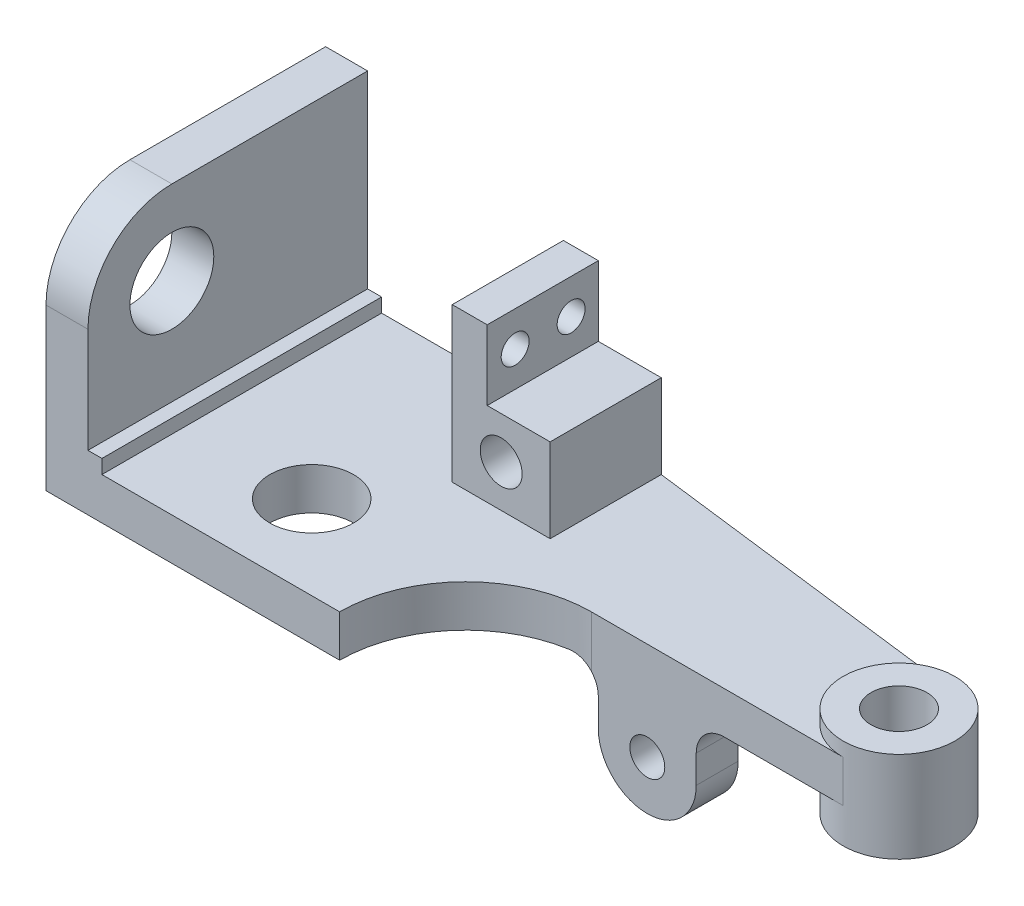
ISO-10303-21;
HEADER;
FILE_DESCRIPTION(('STEP AP214'),'2;1');
FILE_NAME('part.step','',(''),(''),'','','');
FILE_SCHEMA(('AUTOMOTIVE_DESIGN { 1 0 10303 214 1 1 1 1 }'));
ENDSEC;
DATA;
#1=APPLICATION_CONTEXT('core data for automotive mechanical design processes');
#2=APPLICATION_PROTOCOL_DEFINITION('international standard','automotive_design',2000,#1);
#3=PRODUCT_CONTEXT('',#1,'mechanical');
#4=PRODUCT('Part','Part','',(#3));
#5=PRODUCT_RELATED_PRODUCT_CATEGORY('part','',(#4));
#6=PRODUCT_DEFINITION_FORMATION('','',#4);
#7=PRODUCT_DEFINITION_CONTEXT('part definition',#1,'design');
#8=PRODUCT_DEFINITION('design','',#6,#7);
#9=PRODUCT_DEFINITION_SHAPE('','',#8);
#10=(LENGTH_UNIT() NAMED_UNIT(*) SI_UNIT(.MILLI.,.METRE.));
#11=(NAMED_UNIT(*) PLANE_ANGLE_UNIT() SI_UNIT($,.RADIAN.));
#12=(NAMED_UNIT(*) SI_UNIT($,.STERADIAN.) SOLID_ANGLE_UNIT());
#13=UNCERTAINTY_MEASURE_WITH_UNIT(LENGTH_MEASURE(1.E-05),#10,'distance_accuracy_value','');
#14=(GEOMETRIC_REPRESENTATION_CONTEXT(3) GLOBAL_UNCERTAINTY_ASSIGNED_CONTEXT((#13)) GLOBAL_UNIT_ASSIGNED_CONTEXT((#10,
#11,#12)) REPRESENTATION_CONTEXT('',''));
#15=CARTESIAN_POINT('',(0.,0.,0.));
#16=DIRECTION('',(0.,0.,1.));
#17=DIRECTION('',(1.,0.,0.));
#18=AXIS2_PLACEMENT_3D('',#15,#16,#17);
#19=CARTESIAN_POINT('',(95.25,9.525,-28.575));
#20=DIRECTION('',(0.,0.,-1.));
#21=DIRECTION('',(-1.,0.,0.));
#22=AXIS2_PLACEMENT_3D('',#19,#20,#21);
#23=PLANE('',#22);
#24=CARTESIAN_POINT('',(107.95,-12.7,-28.575));
#25=DIRECTION('',(0.,0.,1.));
#26=DIRECTION('',(1.,0.,0.));
#27=AXIS2_PLACEMENT_3D('',#24,#25,#26);
#28=CIRCLE('',#27,3.96874999999999);
#29=CARTESIAN_POINT('',(111.91875,-12.7,-28.575));
#30=VERTEX_POINT('',#29);
#31=EDGE_CURVE('E283',#30,#30,#28,.T.);
#32=ORIENTED_EDGE('',*,*,#31,.F.);
#33=EDGE_LOOP('',(#32));
#34=FACE_BOUND('',#33,.T.);
#35=DIRECTION('',(0.,1.,0.));
#36=VECTOR('',#35,1.);
#37=CARTESIAN_POINT('',(96.8375,-23.8125,-28.575));
#38=LINE('',#37,#36);
#39=CARTESIAN_POINT('',(96.8375,-12.7,-28.575));
#40=VERTEX_POINT('',#39);
#41=CARTESIAN_POINT('',(96.8375,-6.35,-28.575));
#42=VERTEX_POINT('',#41);
#43=EDGE_CURVE('E289',#40,#42,#38,.T.);
#44=ORIENTED_EDGE('',*,*,#43,.F.);
#45=CARTESIAN_POINT('',(107.95,-12.7,-28.575));
#46=DIRECTION('',(0.,0.,1.));
#47=DIRECTION('',(1.,0.,0.));
#48=AXIS2_PLACEMENT_3D('',#45,#46,#47);
#49=CIRCLE('',#48,11.1125);
#50=CARTESIAN_POINT('',(119.0625,-12.7,-28.575));
#51=VERTEX_POINT('',#50);
#52=EDGE_CURVE('E275',#40,#51,#49,.T.);
#53=ORIENTED_EDGE('',*,*,#52,.T.);
#54=DIRECTION('',(0.,1.,0.));
#55=VECTOR('',#54,1.);
#56=CARTESIAN_POINT('',(119.0625,-23.8125,-28.575));
#57=LINE('',#56,#55);
#58=CARTESIAN_POINT('',(119.0625,-6.35,-28.575));
#59=VERTEX_POINT('',#58);
#60=EDGE_CURVE('E292',#51,#59,#57,.T.);
#61=ORIENTED_EDGE('',*,*,#60,.T.);
#62=CARTESIAN_POINT('',(125.4125,-6.35,-28.575));
#63=DIRECTION('',(0.,0.,-1.));
#64=DIRECTION('',(-1.,0.,0.));
#65=AXIS2_PLACEMENT_3D('',#62,#63,#64);
#66=CIRCLE('',#65,6.35);
#67=CARTESIAN_POINT('',(125.4125,0.,-28.575));
#68=VERTEX_POINT('',#67);
#69=EDGE_CURVE('E458',#59,#68,#66,.T.);
#70=ORIENTED_EDGE('',*,*,#69,.T.);
#71=DIRECTION('',(1.,0.,0.));
#72=VECTOR('',#71,1.);
#73=CARTESIAN_POINT('',(95.25,0.,-28.575));
#74=LINE('',#73,#72);
#75=CARTESIAN_POINT('',(152.4,0.,-28.575));
#76=VERTEX_POINT('',#75);
#77=EDGE_CURVE('E444',#68,#76,#74,.T.);
#78=ORIENTED_EDGE('',*,*,#77,.T.);
#79=DIRECTION('',(0.,-1.,0.));
#80=VECTOR('',#79,1.);
#81=CARTESIAN_POINT('',(152.4,9.525,-28.575));
#82=LINE('',#81,#80);
#83=CARTESIAN_POINT('',(152.4,9.525,-28.575));
#84=VERTEX_POINT('',#83);
#85=EDGE_CURVE('E441',#84,#76,#82,.T.);
#86=ORIENTED_EDGE('',*,*,#85,.F.);
#87=DIRECTION('',(1.,0.,0.));
#88=VECTOR('',#87,1.);
#89=CARTESIAN_POINT('',(95.25,9.525,-28.575));
#90=LINE('',#89,#88);
#91=CARTESIAN_POINT('',(95.25,9.525,-28.575));
#92=VERTEX_POINT('',#91);
#93=EDGE_CURVE('E413',#92,#84,#90,.T.);
#94=ORIENTED_EDGE('',*,*,#93,.F.);
#95=DIRECTION('',(0.,-1.,0.));
#96=VECTOR('',#95,1.);
#97=CARTESIAN_POINT('',(95.25,9.525,-28.575));
#98=LINE('',#97,#96);
#99=CARTESIAN_POINT('',(95.25,-2.14986979368493,-28.575));
#100=VERTEX_POINT('',#99);
#101=EDGE_CURVE('E637',#92,#100,#98,.T.);
#102=ORIENTED_EDGE('',*,*,#101,.T.);
#103=CARTESIAN_POINT('',(90.4875,-6.35,-28.575));
#104=DIRECTION('',(0.,0.,-1.));
#105=DIRECTION('',(-1.,0.,0.));
#106=AXIS2_PLACEMENT_3D('',#103,#104,#105);
#107=CIRCLE('',#106,6.35);
#108=EDGE_CURVE('E12',#100,#42,#107,.T.);
#109=ORIENTED_EDGE('',*,*,#108,.T.);
#110=EDGE_LOOP('',(#44,#53,#61,#70,#78,#86,#94,#102,#109));
#111=FACE_BOUND('',#110,.T.);
#112=ADVANCED_FACE('F87',(#34,#111),#23,.F.);
#113=CARTESIAN_POINT('',(96.8375,-23.8125,-38.1));
#114=DIRECTION('',(0.,0.,1.));
#115=DIRECTION('',(1.,0.,0.));
#116=AXIS2_PLACEMENT_3D('',#113,#114,#115);
#117=PLANE('',#116);
#118=CARTESIAN_POINT('',(107.95,-12.7,-38.1));
#119=DIRECTION('',(0.,0.,1.));
#120=DIRECTION('',(1.,0.,0.));
#121=AXIS2_PLACEMENT_3D('',#118,#119,#120);
#122=CIRCLE('',#121,3.96874999999999);
#123=CARTESIAN_POINT('',(111.91875,-12.7,-38.1));
#124=VERTEX_POINT('',#123);
#125=EDGE_CURVE('E286',#124,#124,#122,.T.);
#126=ORIENTED_EDGE('',*,*,#125,.T.);
#127=EDGE_LOOP('',(#126));
#128=FACE_BOUND('',#127,.T.);
#129=CARTESIAN_POINT('',(107.95,-12.7,-38.1));
#130=DIRECTION('',(0.,0.,1.));
#131=DIRECTION('',(1.,0.,0.));
#132=AXIS2_PLACEMENT_3D('',#129,#130,#131);
#133=CIRCLE('',#132,11.1125);
#134=CARTESIAN_POINT('',(96.8375,-12.7,-38.1));
#135=VERTEX_POINT('',#134);
#136=CARTESIAN_POINT('',(119.0625,-12.7,-38.1));
#137=VERTEX_POINT('',#136);
#138=EDGE_CURVE('E281',#135,#137,#133,.T.);
#139=ORIENTED_EDGE('',*,*,#138,.F.);
#140=DIRECTION('',(0.,1.,0.));
#141=VECTOR('',#140,1.);
#142=CARTESIAN_POINT('',(96.8375,-23.8125,-38.1));
#143=LINE('',#142,#141);
#144=CARTESIAN_POINT('',(96.8375,-6.35,-38.1));
#145=VERTEX_POINT('',#144);
#146=EDGE_CURVE('E298',#135,#145,#143,.T.);
#147=ORIENTED_EDGE('',*,*,#146,.T.);
#148=CARTESIAN_POINT('',(90.4875,-6.35,-38.1));
#149=DIRECTION('',(0.,0.,1.));
#150=DIRECTION('',(1.,0.,0.));
#151=AXIS2_PLACEMENT_3D('',#148,#149,#150);
#152=CIRCLE('',#151,6.35);
#153=CARTESIAN_POINT('',(90.4875,0.,-38.1));
#154=VERTEX_POINT('',#153);
#155=EDGE_CURVE('E462',#145,#154,#152,.T.);
#156=ORIENTED_EDGE('',*,*,#155,.T.);
#157=DIRECTION('',(1.,0.,0.));
#158=VECTOR('',#157,1.);
#159=CARTESIAN_POINT('',(96.8375,0.,-38.1));
#160=LINE('',#159,#158);
#161=CARTESIAN_POINT('',(125.4125,0.,-38.1));
#162=VERTEX_POINT('',#161);
#163=EDGE_CURVE('E287',#154,#162,#160,.T.);
#164=ORIENTED_EDGE('',*,*,#163,.T.);
#165=CARTESIAN_POINT('',(125.4125,-6.35,-38.1));
#166=DIRECTION('',(0.,0.,1.));
#167=DIRECTION('',(1.,0.,0.));
#168=AXIS2_PLACEMENT_3D('',#165,#166,#167);
#169=CIRCLE('',#168,6.35);
#170=CARTESIAN_POINT('',(119.0625,-6.35,-38.1));
#171=VERTEX_POINT('',#170);
#172=EDGE_CURVE('E460',#162,#171,#169,.T.);
#173=ORIENTED_EDGE('',*,*,#172,.T.);
#174=DIRECTION('',(0.,1.,0.));
#175=VECTOR('',#174,1.);
#176=CARTESIAN_POINT('',(119.0625,-23.8125,-38.1));
#177=LINE('',#176,#175);
#178=EDGE_CURVE('E295',#137,#171,#177,.T.);
#179=ORIENTED_EDGE('',*,*,#178,.F.);
#180=EDGE_LOOP('',(#139,#147,#156,#164,#173,#179));
#181=FACE_BOUND('',#180,.T.);
#182=ADVANCED_FACE('F500',(#128,#181),#117,.F.);
#183=CARTESIAN_POINT('',(119.0625,-23.8125,-28.575));
#184=DIRECTION('',(-1.,0.,0.));
#185=DIRECTION('',(0.,0.,1.));
#186=AXIS2_PLACEMENT_3D('',#183,#184,#185);
#187=PLANE('',#186);
#188=ORIENTED_EDGE('',*,*,#178,.T.);
#189=DIRECTION('',(0.,0.,1.));
#190=VECTOR('',#189,1.);
#191=CARTESIAN_POINT('',(119.0625,-6.35,-28.575));
#192=LINE('',#191,#190);
#193=EDGE_CURVE('E448',#171,#59,#192,.T.);
#194=ORIENTED_EDGE('',*,*,#193,.T.);
#195=ORIENTED_EDGE('',*,*,#60,.F.);
#196=DIRECTION('',(0.,0.,1.));
#197=VECTOR('',#196,1.);
#198=CARTESIAN_POINT('',(119.0625,-12.7,-63.50005));
#199=LINE('',#198,#197);
#200=EDGE_CURVE('E279',#137,#51,#199,.T.);
#201=ORIENTED_EDGE('',*,*,#200,.F.);
#202=EDGE_LOOP('',(#188,#194,#195,#201));
#203=FACE_BOUND('',#202,.T.);
#204=ADVANCED_FACE('F505',(#203),#187,.F.);
#205=CARTESIAN_POINT('',(152.4,0.,-41.275));
#206=DIRECTION('',(0.,1.,0.));
#207=DIRECTION('',(0.,0.,1.));
#208=AXIS2_PLACEMENT_3D('',#205,#206,#207);
#209=PLANE('',#208);
#210=CARTESIAN_POINT('',(41.275,0.,-19.05));
#211=DIRECTION('',(0.,1.,0.));
#212=DIRECTION('',(0.,0.,1.));
#213=AXIS2_PLACEMENT_3D('',#210,#211,#212);
#214=CIRCLE('',#213,9.525);
#215=CARTESIAN_POINT('',(41.275,0.,-9.525));
#216=VERTEX_POINT('',#215);
#217=EDGE_CURVE('E406',#216,#216,#214,.T.);
#218=ORIENTED_EDGE('',*,*,#217,.T.);
#219=EDGE_LOOP('',(#218));
#220=FACE_BOUND('',#219,.T.);
#221=ORIENTED_EDGE('',*,*,#77,.F.);
#222=DIRECTION('',(0.,0.,1.));
#223=VECTOR('',#222,1.);
#224=CARTESIAN_POINT('',(125.4125,0.,-38.1));
#225=LINE('',#224,#223);
#226=EDGE_CURVE('E452',#68,#162,#225,.F.);
#227=ORIENTED_EDGE('',*,*,#226,.T.);
#228=ORIENTED_EDGE('',*,*,#163,.F.);
#229=DIRECTION('',(0.,0.,-1.));
#230=VECTOR('',#229,1.);
#231=CARTESIAN_POINT('',(90.4875,0.,-28.575));
#232=LINE('',#231,#230);
#233=CARTESIAN_POINT('',(90.4875,0.,-28.1753299670119));
#234=VERTEX_POINT('',#233);
#235=EDGE_CURVE('E450',#154,#234,#232,.F.);
#236=ORIENTED_EDGE('',*,*,#235,.T.);
#237=CARTESIAN_POINT('',(95.25,0.,0.));
#238=DIRECTION('',(0.,-1.,0.));
#239=DIRECTION('',(0.,0.,-1.));
#240=AXIS2_PLACEMENT_3D('',#237,#238,#239);
#241=CIRCLE('',#240,28.575);
#242=CARTESIAN_POINT('',(66.675,0.,0.));
#243=VERTEX_POINT('',#242);
#244=EDGE_CURVE('E447',#243,#234,#241,.T.);
#245=ORIENTED_EDGE('',*,*,#244,.F.);
#246=DIRECTION('',(1.,0.,0.));
#247=VECTOR('',#246,1.);
#248=CARTESIAN_POINT('',(0.,0.,0.));
#249=LINE('',#248,#247);
#250=CARTESIAN_POINT('',(0.,0.,0.));
#251=VERTEX_POINT('',#250);
#252=EDGE_CURVE('E673',#251,#243,#249,.T.);
#253=ORIENTED_EDGE('',*,*,#252,.F.);
#254=DIRECTION('',(0.,0.,1.));
#255=VECTOR('',#254,1.);
#256=CARTESIAN_POINT('',(0.,0.,0.));
#257=LINE('',#256,#255);
#258=CARTESIAN_POINT('',(0.,0.,-63.5));
#259=VERTEX_POINT('',#258);
#260=EDGE_CURVE('E405',#259,#251,#257,.T.);
#261=ORIENTED_EDGE('',*,*,#260,.F.);
#262=DIRECTION('',(-1.,0.,0.));
#263=VECTOR('',#262,1.);
#264=CARTESIAN_POINT('',(0.,0.,-63.5));
#265=LINE('',#264,#263);
#266=CARTESIAN_POINT('',(76.2,0.,-63.5));
#267=VERTEX_POINT('',#266);
#268=EDGE_CURVE('E667',#267,#259,#265,.T.);
#269=ORIENTED_EDGE('',*,*,#268,.F.);
#270=DIRECTION('',(-0.992277876713668,0.,-0.124034734589209));
#271=VECTOR('',#270,1.);
#272=CARTESIAN_POINT('',(152.4,0.,-53.975));
#273=LINE('',#272,#271);
#274=CARTESIAN_POINT('',(152.4,0.,-53.975));
#275=VERTEX_POINT('',#274);
#276=EDGE_CURVE('E428',#275,#267,#273,.T.);
#277=ORIENTED_EDGE('',*,*,#276,.F.);
#278=CARTESIAN_POINT('',(152.4,0.,-41.275));
#279=DIRECTION('',(0.,-1.,0.));
#280=DIRECTION('',(0.,0.,-1.));
#281=AXIS2_PLACEMENT_3D('',#278,#279,#280);
#282=CIRCLE('',#281,12.7);
#283=EDGE_CURVE('E431',#76,#275,#282,.T.);
#284=ORIENTED_EDGE('',*,*,#283,.F.);
#285=EDGE_LOOP('',(#221,#227,#228,#236,#245,#253,#261,#269,#277,#284));
#286=FACE_BOUND('',#285,.T.);
#287=ADVANCED_FACE('F541',(#220,#286),#209,.F.);
#288=CARTESIAN_POINT('',(0.,28.575,0.));
#289=DIRECTION('',(0.,-1.,0.));
#290=DIRECTION('',(0.,0.,-1.));
#291=AXIS2_PLACEMENT_3D('',#288,#289,#290);
#292=PLANE('',#291);
#293=DIRECTION('',(0.,0.,-1.));
#294=VECTOR('',#293,1.);
#295=CARTESIAN_POINT('',(61.9125,28.575,-63.5));
#296=LINE('',#295,#294);
#297=CARTESIAN_POINT('',(61.9125,28.575,-38.2663264185679));
#298=VERTEX_POINT('',#297);
#299=CARTESIAN_POINT('',(61.9125,28.575,-63.5));
#300=VERTEX_POINT('',#299);
#301=EDGE_CURVE('E328',#298,#300,#296,.T.);
#302=ORIENTED_EDGE('',*,*,#301,.F.);
#303=DIRECTION('',(1.,0.,0.));
#304=VECTOR('',#303,1.);
#305=CARTESIAN_POINT('',(76.2,28.575,-38.2663264185679));
#306=LINE('',#305,#304);
#307=CARTESIAN_POINT('',(76.2,28.575,-38.2663264185679));
#308=VERTEX_POINT('',#307);
#309=EDGE_CURVE('E354',#298,#308,#306,.T.);
#310=ORIENTED_EDGE('',*,*,#309,.T.);
#311=DIRECTION('',(0.,0.,-1.));
#312=VECTOR('',#311,1.);
#313=CARTESIAN_POINT('',(76.2,28.575,-63.5));
#314=LINE('',#313,#312);
#315=CARTESIAN_POINT('',(76.2,28.575,-63.5));
#316=VERTEX_POINT('',#315);
#317=EDGE_CURVE('E348',#308,#316,#314,.T.);
#318=ORIENTED_EDGE('',*,*,#317,.T.);
#319=DIRECTION('',(-1.,0.,0.));
#320=VECTOR('',#319,1.);
#321=CARTESIAN_POINT('',(76.2,28.575,-63.5));
#322=LINE('',#321,#320);
#323=EDGE_CURVE('E351',#316,#300,#322,.T.);
#324=ORIENTED_EDGE('',*,*,#323,.T.);
#325=EDGE_LOOP('',(#302,#310,#318,#324));
#326=FACE_BOUND('',#325,.T.);
#327=ADVANCED_FACE('F572',(#326),#292,.F.);
#328=CARTESIAN_POINT('',(152.4,9.525,-41.275));
#329=DIRECTION('',(0.,1.,0.));
#330=DIRECTION('',(0.,0.,1.));
#331=AXIS2_PLACEMENT_3D('',#328,#329,#330);
#332=PLANE('',#331);
#333=DIRECTION('',(0.,0.,1.));
#334=VECTOR('',#333,1.);
#335=CARTESIAN_POINT('',(12.7,9.525,-63.5));
#336=LINE('',#335,#334);
#337=CARTESIAN_POINT('',(12.7,9.525,-63.5));
#338=VERTEX_POINT('',#337);
#339=CARTESIAN_POINT('',(12.7,9.525,0.));
#340=VERTEX_POINT('',#339);
#341=EDGE_CURVE('E105',#338,#340,#336,.T.);
#342=ORIENTED_EDGE('',*,*,#341,.T.);
#343=DIRECTION('',(1.,0.,0.));
#344=VECTOR('',#343,1.);
#345=CARTESIAN_POINT('',(0.,9.525,0.));
#346=LINE('',#345,#344);
#347=CARTESIAN_POINT('',(66.675,9.525,0.));
#348=VERTEX_POINT('',#347);
#349=EDGE_CURVE('E92',#340,#348,#346,.T.);
#350=ORIENTED_EDGE('',*,*,#349,.T.);
#351=CARTESIAN_POINT('',(95.25,9.525,0.));
#352=DIRECTION('',(0.,-1.,0.));
#353=DIRECTION('',(0.,0.,-1.));
#354=AXIS2_PLACEMENT_3D('',#351,#352,#353);
#355=CIRCLE('',#354,28.575);
#356=EDGE_CURVE('E411',#348,#92,#355,.T.);
#357=ORIENTED_EDGE('',*,*,#356,.T.);
#358=ORIENTED_EDGE('',*,*,#93,.T.);
#359=CARTESIAN_POINT('',(152.4,9.525,-41.275));
#360=DIRECTION('',(0.,1.,0.));
#361=DIRECTION('',(0.,0.,1.));
#362=AXIS2_PLACEMENT_3D('',#359,#360,#361);
#363=CIRCLE('',#362,12.7);
#364=CARTESIAN_POINT('',(152.4,9.525,-53.975));
#365=VERTEX_POINT('',#364);
#366=EDGE_CURVE('E375',#365,#84,#363,.T.);
#367=ORIENTED_EDGE('',*,*,#366,.F.);
#368=DIRECTION('',(-0.992277876713668,0.,-0.124034734589209));
#369=VECTOR('',#368,1.);
#370=CARTESIAN_POINT('',(152.4,9.525,-53.975));
#371=LINE('',#370,#369);
#372=CARTESIAN_POINT('',(76.2,9.525,-63.5));
#373=VERTEX_POINT('',#372);
#374=EDGE_CURVE('E415',#365,#373,#371,.T.);
#375=ORIENTED_EDGE('',*,*,#374,.T.);
#376=DIRECTION('',(0.,0.,-1.));
#377=VECTOR('',#376,1.);
#378=CARTESIAN_POINT('',(76.2,9.525,-63.5));
#379=LINE('',#378,#377);
#380=CARTESIAN_POINT('',(76.2,9.525,-38.2663264185679));
#381=VERTEX_POINT('',#380);
#382=EDGE_CURVE('E347',#381,#373,#379,.T.);
#383=ORIENTED_EDGE('',*,*,#382,.F.);
#384=DIRECTION('',(1.,0.,0.));
#385=VECTOR('',#384,1.);
#386=CARTESIAN_POINT('',(76.2,9.525,-38.2663264185679));
#387=LINE('',#386,#385);
#388=CARTESIAN_POINT('',(53.975,9.525,-38.2663264185679));
#389=VERTEX_POINT('',#388);
#390=EDGE_CURVE('E352',#389,#381,#387,.T.);
#391=ORIENTED_EDGE('',*,*,#390,.F.);
#392=DIRECTION('',(0.,0.,1.));
#393=VECTOR('',#392,1.);
#394=CARTESIAN_POINT('',(53.975,9.525,-63.5));
#395=LINE('',#394,#393);
#396=CARTESIAN_POINT('',(53.975,9.525,-63.5));
#397=VERTEX_POINT('',#396);
#398=EDGE_CURVE('E359',#397,#389,#395,.T.);
#399=ORIENTED_EDGE('',*,*,#398,.F.);
#400=DIRECTION('',(-1.,0.,0.));
#401=VECTOR('',#400,1.);
#402=CARTESIAN_POINT('',(61.9125,9.525,-63.5));
#403=LINE('',#402,#401);
#404=EDGE_CURVE('E110',#397,#338,#403,.T.);
#405=ORIENTED_EDGE('',*,*,#404,.T.);
#406=EDGE_LOOP('',(#342,#350,#357,#358,#367,#375,#383,#391,#399,#405));
#407=FACE_BOUND('',#406,.T.);
#408=CARTESIAN_POINT('',(41.275,9.525,-19.05));
#409=DIRECTION('',(0.,1.,0.));
#410=DIRECTION('',(0.,0.,1.));
#411=AXIS2_PLACEMENT_3D('',#408,#409,#410);
#412=CIRCLE('',#411,9.525);
#413=CARTESIAN_POINT('',(41.275,9.525,-9.525));
#414=VERTEX_POINT('',#413);
#415=EDGE_CURVE('E402',#414,#414,#412,.T.);
#416=ORIENTED_EDGE('',*,*,#415,.F.);
#417=EDGE_LOOP('',(#416));
#418=FACE_BOUND('',#417,.T.);
#419=ADVANCED_FACE('F575',(#407,#418),#332,.T.);
#420=CARTESIAN_POINT('',(0.,55.5625,0.));
#421=DIRECTION('',(0.,-1.,0.));
#422=DIRECTION('',(0.,0.,-1.));
#423=AXIS2_PLACEMENT_3D('',#420,#421,#422);
#424=PLANE('',#423);
#425=DIRECTION('',(1.,0.,0.));
#426=VECTOR('',#425,1.);
#427=CARTESIAN_POINT('',(-36.5125,55.5625,-19.05));
#428=LINE('',#427,#426);
#429=CARTESIAN_POINT('',(9.525,55.5625,-19.05));
#430=VERTEX_POINT('',#429);
#431=CARTESIAN_POINT('',(0.,55.5625,-19.05));
#432=VERTEX_POINT('',#431);
#433=EDGE_CURVE('E436',#430,#432,#428,.F.);
#434=ORIENTED_EDGE('',*,*,#433,.F.);
#435=DIRECTION('',(0.,0.,-1.));
#436=VECTOR('',#435,1.);
#437=CARTESIAN_POINT('',(9.525,55.5625,0.));
#438=LINE('',#437,#436);
#439=CARTESIAN_POINT('',(9.525,55.5625,-63.5));
#440=VERTEX_POINT('',#439);
#441=EDGE_CURVE('E397',#430,#440,#438,.T.);
#442=ORIENTED_EDGE('',*,*,#441,.T.);
#443=DIRECTION('',(-1.,0.,0.));
#444=VECTOR('',#443,1.);
#445=CARTESIAN_POINT('',(0.,55.5625,-63.5));
#446=LINE('',#445,#444);
#447=CARTESIAN_POINT('',(0.,55.5625,-63.5));
#448=VERTEX_POINT('',#447);
#449=EDGE_CURVE('E399',#440,#448,#446,.T.);
#450=ORIENTED_EDGE('',*,*,#449,.T.);
#451=DIRECTION('',(0.,0.,1.));
#452=VECTOR('',#451,1.);
#453=CARTESIAN_POINT('',(0.,55.5625,0.));
#454=LINE('',#453,#452);
#455=EDGE_CURVE('E394',#448,#432,#454,.T.);
#456=ORIENTED_EDGE('',*,*,#455,.T.);
#457=EDGE_LOOP('',(#434,#442,#450,#456));
#458=FACE_BOUND('',#457,.T.);
#459=ADVANCED_FACE('F484',(#458),#424,.F.);
#460=CARTESIAN_POINT('',(0.,9.525,0.));
#461=DIRECTION('',(1.,0.,0.));
#462=DIRECTION('',(0.,0.,-1.));
#463=AXIS2_PLACEMENT_3D('',#460,#461,#462);
#464=PLANE('',#463);
#465=CARTESIAN_POINT('',(0.,36.5125,-19.05));
#466=DIRECTION('',(1.,0.,0.));
#467=DIRECTION('',(0.,0.,-1.));
#468=AXIS2_PLACEMENT_3D('',#465,#466,#467);
#469=CIRCLE('',#468,9.525);
#470=CARTESIAN_POINT('',(0.,36.5125,-28.575));
#471=VERTEX_POINT('',#470);
#472=EDGE_CURVE('E391',#471,#471,#469,.T.);
#473=ORIENTED_EDGE('',*,*,#472,.T.);
#474=EDGE_LOOP('',(#473));
#475=FACE_BOUND('',#474,.T.);
#476=DIRECTION('',(0.,-1.,0.));
#477=VECTOR('',#476,1.);
#478=CARTESIAN_POINT('',(0.,9.525,0.));
#479=LINE('',#478,#477);
#480=CARTESIAN_POINT('',(0.,36.5125,0.));
#481=VERTEX_POINT('',#480);
#482=EDGE_CURVE('E654',#481,#251,#479,.T.);
#483=ORIENTED_EDGE('',*,*,#482,.F.);
#484=CARTESIAN_POINT('',(0.,36.5125,-19.05));
#485=DIRECTION('',(1.,0.,0.));
#486=DIRECTION('',(0.,0.,-1.));
#487=AXIS2_PLACEMENT_3D('',#484,#485,#486);
#488=CIRCLE('',#487,19.05);
#489=EDGE_CURVE('E385',#481,#432,#488,.F.);
#490=ORIENTED_EDGE('',*,*,#489,.T.);
#491=ORIENTED_EDGE('',*,*,#455,.F.);
#492=DIRECTION('',(0.,-1.,0.));
#493=VECTOR('',#492,1.);
#494=CARTESIAN_POINT('',(0.,9.525,-63.5));
#495=LINE('',#494,#493);
#496=EDGE_CURVE('E423',#448,#259,#495,.T.);
#497=ORIENTED_EDGE('',*,*,#496,.T.);
#498=ORIENTED_EDGE('',*,*,#260,.T.);
#499=EDGE_LOOP('',(#483,#490,#491,#497,#498));
#500=FACE_BOUND('',#499,.T.);
#501=ADVANCED_FACE('F481',(#475,#500),#464,.F.);
#502=CARTESIAN_POINT('',(0.,9.525,0.));
#503=DIRECTION('',(0.,0.,-1.));
#504=DIRECTION('',(-1.,0.,0.));
#505=AXIS2_PLACEMENT_3D('',#502,#503,#504);
#506=PLANE('',#505);
#507=ORIENTED_EDGE('',*,*,#349,.F.);
#508=DIRECTION('',(0.,1.,0.));
#509=VECTOR('',#508,1.);
#510=CARTESIAN_POINT('',(12.7,9.525,0.));
#511=LINE('',#510,#509);
#512=CARTESIAN_POINT('',(12.7,12.7,0.));
#513=VERTEX_POINT('',#512);
#514=EDGE_CURVE('E272',#340,#513,#511,.T.);
#515=ORIENTED_EDGE('',*,*,#514,.T.);
#516=DIRECTION('',(-1.,0.,0.));
#517=VECTOR('',#516,1.);
#518=CARTESIAN_POINT('',(9.525,12.7,0.));
#519=LINE('',#518,#517);
#520=CARTESIAN_POINT('',(9.525,12.7,0.));
#521=VERTEX_POINT('',#520);
#522=EDGE_CURVE('E252',#513,#521,#519,.T.);
#523=ORIENTED_EDGE('',*,*,#522,.T.);
#524=DIRECTION('',(0.,-1.,0.));
#525=VECTOR('',#524,1.);
#526=CARTESIAN_POINT('',(9.525,55.5625,0.));
#527=LINE('',#526,#525);
#528=CARTESIAN_POINT('',(9.525,36.5125,0.));
#529=VERTEX_POINT('',#528);
#530=EDGE_CURVE('E408',#529,#521,#527,.T.);
#531=ORIENTED_EDGE('',*,*,#530,.F.);
#532=DIRECTION('',(1.,0.,0.));
#533=VECTOR('',#532,1.);
#534=CARTESIAN_POINT('',(-36.5125,36.5125,0.));
#535=LINE('',#534,#533);
#536=EDGE_CURVE('E383',#481,#529,#535,.T.);
#537=ORIENTED_EDGE('',*,*,#536,.F.);
#538=ORIENTED_EDGE('',*,*,#482,.T.);
#539=ORIENTED_EDGE('',*,*,#252,.T.);
#540=DIRECTION('',(0.,-1.,0.));
#541=VECTOR('',#540,1.);
#542=CARTESIAN_POINT('',(66.675,9.525,0.));
#543=LINE('',#542,#541);
#544=EDGE_CURVE('E639',#348,#243,#543,.T.);
#545=ORIENTED_EDGE('',*,*,#544,.F.);
#546=EDGE_LOOP('',(#507,#515,#523,#531,#537,#538,#539,#545));
#547=FACE_BOUND('',#546,.T.);
#548=ADVANCED_FACE('F476',(#547),#506,.F.);
#549=CARTESIAN_POINT('',(95.25,9.525,0.));
#550=DIRECTION('',(0.,-1.,0.));
#551=DIRECTION('',(0.,0.,-1.));
#552=AXIS2_PLACEMENT_3D('',#549,#550,#551);
#553=CYLINDRICAL_SURFACE('',#552,28.575);
#554=ORIENTED_EDGE('',*,*,#244,.T.);
#555=CARTESIAN_POINT('',(90.4875,0.,-28.1753299670119));
#556=CARTESIAN_POINT('',(90.6613034391203,2.07788100532369E-05,-28.2047241582629));
#557=CARTESIAN_POINT('',(90.8353906081418,-0.00713504540515849,-28.2324805663496));
#558=CARTESIAN_POINT('',(91.1828977785426,-0.0357898843089191,-28.2846236418446));
#559=CARTESIAN_POINT('',(91.3563177386743,-0.0572897718756807,-28.3090101040729));
#560=CARTESIAN_POINT('',(91.701158762223,-0.114610148149816,-28.3543055764779));
#561=CARTESIAN_POINT('',(91.8725806690322,-0.150424351419796,-28.3752161072426));
#562=CARTESIAN_POINT('',(92.2122286779602,-0.236205442733259,-28.4135840992128));
#563=CARTESIAN_POINT('',(92.3804549933941,-0.286171382539645,-28.4310417916425));
#564=CARTESIAN_POINT('',(92.7126728082575,-0.400043890921936,-28.4626154390882));
#565=CARTESIAN_POINT('',(92.8766589706755,-0.4639671549902,-28.4767273494078));
#566=CARTESIAN_POINT('',(93.1989602267913,-0.605311293771183,-28.5017541547165));
#567=CARTESIAN_POINT('',(93.3572753004575,-0.682732216155057,-28.5126690384138));
#568=CARTESIAN_POINT('',(93.6668985936843,-0.850464515407376,-28.5315342858627));
#569=CARTESIAN_POINT('',(93.8182137821993,-0.940762689477037,-28.5394876562029));
#570=CARTESIAN_POINT('',(94.1128473217269,-1.13364490750614,-28.5527452038371));
#571=CARTESIAN_POINT('',(94.2561681698495,-1.23622508320303,-28.5580502125354));
#572=CARTESIAN_POINT('',(94.5495792130265,-1.46528567158354,-28.5668327404553));
#573=CARTESIAN_POINT('',(94.6985940875537,-1.59315723327733,-28.5700348115458));
#574=CARTESIAN_POINT('',(94.9840147228799,-1.86197670015115,-28.5741194955508));
#575=CARTESIAN_POINT('',(95.1204355411883,-2.00290857535153,-28.5750049138422));
#576=CARTESIAN_POINT('',(95.25,-2.14986979368493,-28.575));
#577=B_SPLINE_CURVE_WITH_KNOTS('',3,(#555,#556,#557,#558,#559,#560,#561,#562,#563,#564,#565,
#566,#567,#568,#569,#570,#571,#572,#573,#574,#575,#576),.UNSPECIFIED.,.F.,.F.,(4,2,2,2,2,2,2,2,
2,2,4),(0.,0.528671504172429,1.05737518248702,1.58584696083068,2.11428333729705,
2.64335531670023,3.17242916472259,3.70096441220385,4.22933363125771,4.81761830651145,
5.40519026133262),.UNSPECIFIED.);
#578=EDGE_CURVE('E98',#234,#100,#577,.T.);
#579=ORIENTED_EDGE('',*,*,#578,.T.);
#580=ORIENTED_EDGE('',*,*,#101,.F.);
#581=ORIENTED_EDGE('',*,*,#356,.F.);
#582=ORIENTED_EDGE('',*,*,#544,.T.);
#583=EDGE_LOOP('',(#554,#579,#580,#581,#582));
#584=FACE_BOUND('',#583,.T.);
#585=ADVANCED_FACE('F470',(#584),#553,.F.);
#586=CARTESIAN_POINT('',(152.4,9.525,-41.275));
#587=DIRECTION('',(0.,-1.,0.));
#588=DIRECTION('',(0.,0.,-1.));
#589=AXIS2_PLACEMENT_3D('',#586,#587,#588);
#590=CYLINDRICAL_SURFACE('',#589,12.7);
#591=ORIENTED_EDGE('',*,*,#85,.T.);
#592=ORIENTED_EDGE('',*,*,#283,.T.);
#593=DIRECTION('',(0.,-1.,0.));
#594=VECTOR('',#593,1.);
#595=CARTESIAN_POINT('',(152.4,9.525,-53.975));
#596=LINE('',#595,#594);
#597=EDGE_CURVE('E638',#365,#275,#596,.T.);
#598=ORIENTED_EDGE('',*,*,#597,.F.);
#599=ORIENTED_EDGE('',*,*,#366,.T.);
#600=EDGE_LOOP('',(#591,#592,#598,#599));
#601=FACE_BOUND('',#600,.T.);
#602=CARTESIAN_POINT('',(152.4,12.7,-41.275));
#603=DIRECTION('',(0.,1.,0.));
#604=DIRECTION('',(0.,0.,1.));
#605=AXIS2_PLACEMENT_3D('',#602,#603,#604);
#606=CIRCLE('',#605,12.7);
#607=CARTESIAN_POINT('',(152.4,12.7,-28.575));
#608=VERTEX_POINT('',#607);
#609=EDGE_CURVE('E376',#608,#608,#606,.T.);
#610=ORIENTED_EDGE('',*,*,#609,.F.);
#611=EDGE_LOOP('',(#610));
#612=FACE_BOUND('',#611,.T.);
#613=CARTESIAN_POINT('',(152.4,-7.9375,-41.275));
#614=DIRECTION('',(0.,-1.,0.));
#615=DIRECTION('',(0.,0.,-1.));
#616=AXIS2_PLACEMENT_3D('',#613,#614,#615);
#617=CIRCLE('',#616,12.7);
#618=CARTESIAN_POINT('',(152.4,-7.9375,-53.975));
#619=VERTEX_POINT('',#618);
#620=EDGE_CURVE('E305',#619,#619,#617,.T.);
#621=ORIENTED_EDGE('',*,*,#620,.F.);
#622=EDGE_LOOP('',(#621));
#623=FACE_BOUND('',#622,.T.);
#624=ADVANCED_FACE('F475',(#601,#612,#623),#590,.T.);
#625=CARTESIAN_POINT('',(152.4,9.525,-53.975));
#626=DIRECTION('',(-0.124034734589208,0.,0.992277876713668));
#627=DIRECTION('',(0.992277876713668,0.,0.124034734589209));
#628=AXIS2_PLACEMENT_3D('',#625,#626,#627);
#629=PLANE('',#628);
#630=ORIENTED_EDGE('',*,*,#276,.T.);
#631=DIRECTION('',(0.,-1.,0.));
#632=VECTOR('',#631,1.);
#633=CARTESIAN_POINT('',(76.2,9.525,-63.5));
#634=LINE('',#633,#632);
#635=EDGE_CURVE('E642',#373,#267,#634,.T.);
#636=ORIENTED_EDGE('',*,*,#635,.F.);
#637=ORIENTED_EDGE('',*,*,#374,.F.);
#638=ORIENTED_EDGE('',*,*,#597,.T.);
#639=EDGE_LOOP('',(#630,#636,#637,#638));
#640=FACE_BOUND('',#639,.T.);
#641=ADVANCED_FACE('F618',(#640),#629,.F.);
#642=CARTESIAN_POINT('',(0.,9.525,-63.5));
#643=DIRECTION('',(0.,0.,1.));
#644=DIRECTION('',(1.,0.,0.));
#645=AXIS2_PLACEMENT_3D('',#642,#643,#644);
#646=PLANE('',#645);
#647=DIRECTION('',(0.,1.,0.));
#648=VECTOR('',#647,1.);
#649=CARTESIAN_POINT('',(12.7,9.525,-63.5));
#650=LINE('',#649,#648);
#651=CARTESIAN_POINT('',(12.7,12.7,-63.5));
#652=VERTEX_POINT('',#651);
#653=EDGE_CURVE('E259',#338,#652,#650,.T.);
#654=ORIENTED_EDGE('',*,*,#653,.F.);
#655=ORIENTED_EDGE('',*,*,#404,.F.);
#656=DIRECTION('',(0.,-1.,0.));
#657=VECTOR('',#656,1.);
#658=CARTESIAN_POINT('',(53.975,28.575,-63.5));
#659=LINE('',#658,#657);
#660=CARTESIAN_POINT('',(53.975,44.45,-63.5));
#661=VERTEX_POINT('',#660);
#662=EDGE_CURVE('E369',#661,#397,#659,.T.);
#663=ORIENTED_EDGE('',*,*,#662,.F.);
#664=DIRECTION('',(-1.,0.,0.));
#665=VECTOR('',#664,1.);
#666=CARTESIAN_POINT('',(53.975,44.45,-63.5));
#667=LINE('',#666,#665);
#668=CARTESIAN_POINT('',(61.9125,44.45,-63.5));
#669=VERTEX_POINT('',#668);
#670=EDGE_CURVE('E336',#669,#661,#667,.T.);
#671=ORIENTED_EDGE('',*,*,#670,.F.);
#672=DIRECTION('',(0.,-1.,0.));
#673=VECTOR('',#672,1.);
#674=CARTESIAN_POINT('',(61.9125,44.45,-63.5));
#675=LINE('',#674,#673);
#676=EDGE_CURVE('E339',#669,#300,#675,.T.);
#677=ORIENTED_EDGE('',*,*,#676,.T.);
#678=ORIENTED_EDGE('',*,*,#323,.F.);
#679=DIRECTION('',(0.,-1.,0.));
#680=VECTOR('',#679,1.);
#681=CARTESIAN_POINT('',(76.2,28.575,-63.5));
#682=LINE('',#681,#680);
#683=EDGE_CURVE('E372',#316,#373,#682,.T.);
#684=ORIENTED_EDGE('',*,*,#683,.T.);
#685=ORIENTED_EDGE('',*,*,#635,.T.);
#686=ORIENTED_EDGE('',*,*,#268,.T.);
#687=ORIENTED_EDGE('',*,*,#496,.F.);
#688=ORIENTED_EDGE('',*,*,#449,.F.);
#689=DIRECTION('',(0.,-1.,0.));
#690=VECTOR('',#689,1.);
#691=CARTESIAN_POINT('',(9.525,55.5625,-63.5));
#692=LINE('',#691,#690);
#693=CARTESIAN_POINT('',(9.525,12.7,-63.5));
#694=VERTEX_POINT('',#693);
#695=EDGE_CURVE('E268',#440,#694,#692,.T.);
#696=ORIENTED_EDGE('',*,*,#695,.T.);
#697=DIRECTION('',(-1.,0.,0.));
#698=VECTOR('',#697,1.);
#699=CARTESIAN_POINT('',(9.525,12.7,-63.5));
#700=LINE('',#699,#698);
#701=EDGE_CURVE('E250',#652,#694,#700,.T.);
#702=ORIENTED_EDGE('',*,*,#701,.F.);
#703=EDGE_LOOP('',(#654,#655,#663,#671,#677,#678,#684,#685,#686,#687,#688,#696,#702));
#704=FACE_BOUND('',#703,.T.);
#705=CARTESIAN_POINT('',(65.0875,19.05,-63.5));
#706=DIRECTION('',(0.,0.,1.));
#707=DIRECTION('',(1.,0.,0.));
#708=AXIS2_PLACEMENT_3D('',#705,#706,#707);
#709=CIRCLE('',#708,4.7625);
#710=CARTESIAN_POINT('',(69.85,19.05,-63.5));
#711=VERTEX_POINT('',#710);
#712=EDGE_CURVE('E313',#711,#711,#709,.T.);
#713=ORIENTED_EDGE('',*,*,#712,.T.);
#714=EDGE_LOOP('',(#713));
#715=FACE_BOUND('',#714,.T.);
#716=ADVANCED_FACE('F264',(#704,#715),#646,.F.);
#717=CARTESIAN_POINT('',(41.275,9.525,-19.05));
#718=DIRECTION('',(0.,-1.,0.));
#719=DIRECTION('',(0.,0.,-1.));
#720=AXIS2_PLACEMENT_3D('',#717,#718,#719);
#721=CYLINDRICAL_SURFACE('',#720,9.525);
#722=ORIENTED_EDGE('',*,*,#415,.T.);
#723=EDGE_LOOP('',(#722));
#724=FACE_BOUND('',#723,.T.);
#725=ORIENTED_EDGE('',*,*,#217,.F.);
#726=EDGE_LOOP('',(#725));
#727=FACE_BOUND('',#726,.T.);
#728=ADVANCED_FACE('F606',(#724,#727),#721,.F.);
#729=CARTESIAN_POINT('',(9.525,55.5625,0.));
#730=DIRECTION('',(-1.,0.,0.));
#731=DIRECTION('',(0.,0.,1.));
#732=AXIS2_PLACEMENT_3D('',#729,#730,#731);
#733=PLANE('',#732);
#734=CARTESIAN_POINT('',(9.525,36.5125,-19.05));
#735=DIRECTION('',(1.,0.,0.));
#736=DIRECTION('',(0.,0.,-1.));
#737=AXIS2_PLACEMENT_3D('',#734,#735,#736);
#738=CIRCLE('',#737,9.525);
#739=CARTESIAN_POINT('',(9.525,36.5125,-28.575));
#740=VERTEX_POINT('',#739);
#741=EDGE_CURVE('E388',#740,#740,#738,.T.);
#742=ORIENTED_EDGE('',*,*,#741,.F.);
#743=EDGE_LOOP('',(#742));
#744=FACE_BOUND('',#743,.T.);
#745=ORIENTED_EDGE('',*,*,#530,.T.);
#746=DIRECTION('',(0.,0.,1.));
#747=VECTOR('',#746,1.);
#748=CARTESIAN_POINT('',(9.525,12.7,-63.5));
#749=LINE('',#748,#747);
#750=EDGE_CURVE('E256',#694,#521,#749,.T.);
#751=ORIENTED_EDGE('',*,*,#750,.F.);
#752=ORIENTED_EDGE('',*,*,#695,.F.);
#753=ORIENTED_EDGE('',*,*,#441,.F.);
#754=CARTESIAN_POINT('',(9.525,36.5125,-19.05));
#755=DIRECTION('',(1.,0.,0.));
#756=DIRECTION('',(0.,0.,-1.));
#757=AXIS2_PLACEMENT_3D('',#754,#755,#756);
#758=CIRCLE('',#757,19.05);
#759=EDGE_CURVE('E379',#529,#430,#758,.F.);
#760=ORIENTED_EDGE('',*,*,#759,.F.);
#761=EDGE_LOOP('',(#745,#751,#752,#753,#760));
#762=FACE_BOUND('',#761,.T.);
#763=ADVANCED_FACE('F599',(#744,#762),#733,.F.);
#764=CARTESIAN_POINT('',(-36.5125,36.5125,-19.05));
#765=DIRECTION('',(1.,0.,0.));
#766=DIRECTION('',(0.,0.,-1.));
#767=AXIS2_PLACEMENT_3D('',#764,#765,#766);
#768=CYLINDRICAL_SURFACE('',#767,9.525);
#769=ORIENTED_EDGE('',*,*,#741,.T.);
#770=EDGE_LOOP('',(#769));
#771=FACE_BOUND('',#770,.T.);
#772=ORIENTED_EDGE('',*,*,#472,.F.);
#773=EDGE_LOOP('',(#772));
#774=FACE_BOUND('',#773,.T.);
#775=ADVANCED_FACE('F595',(#771,#774),#768,.F.);
#776=CARTESIAN_POINT('',(-36.5125,36.5125,-19.05));
#777=DIRECTION('',(1.,0.,0.));
#778=DIRECTION('',(0.,0.,-1.));
#779=AXIS2_PLACEMENT_3D('',#776,#777,#778);
#780=CYLINDRICAL_SURFACE('',#779,19.05);
#781=ORIENTED_EDGE('',*,*,#536,.T.);
#782=ORIENTED_EDGE('',*,*,#759,.T.);
#783=ORIENTED_EDGE('',*,*,#433,.T.);
#784=ORIENTED_EDGE('',*,*,#489,.F.);
#785=EDGE_LOOP('',(#781,#782,#783,#784));
#786=FACE_BOUND('',#785,.T.);
#787=ADVANCED_FACE('F591',(#786),#780,.T.);
#788=CARTESIAN_POINT('',(152.4,12.7,-41.275));
#789=DIRECTION('',(0.,1.,0.));
#790=DIRECTION('',(0.,0.,1.));
#791=AXIS2_PLACEMENT_3D('',#788,#789,#790);
#792=PLANE('',#791);
#793=CARTESIAN_POINT('',(152.4,12.7,-41.275));
#794=DIRECTION('',(0.,1.,0.));
#795=DIRECTION('',(0.,0.,1.));
#796=AXIS2_PLACEMENT_3D('',#793,#794,#795);
#797=CIRCLE('',#796,6.35);
#798=CARTESIAN_POINT('',(152.4,12.7,-34.925));
#799=VERTEX_POINT('',#798);
#800=EDGE_CURVE('E301',#799,#799,#797,.T.);
#801=ORIENTED_EDGE('',*,*,#800,.F.);
#802=EDGE_LOOP('',(#801));
#803=FACE_BOUND('',#802,.T.);
#804=ORIENTED_EDGE('',*,*,#609,.T.);
#805=EDGE_LOOP('',(#804));
#806=FACE_BOUND('',#805,.T.);
#807=ADVANCED_FACE('F587',(#803,#806),#792,.T.);
#808=CARTESIAN_POINT('',(76.2,28.575,-63.5));
#809=DIRECTION('',(-1.,0.,0.));
#810=DIRECTION('',(0.,0.,1.));
#811=AXIS2_PLACEMENT_3D('',#808,#809,#810);
#812=PLANE('',#811);
#813=ORIENTED_EDGE('',*,*,#382,.T.);
#814=ORIENTED_EDGE('',*,*,#683,.F.);
#815=ORIENTED_EDGE('',*,*,#317,.F.);
#816=DIRECTION('',(0.,-1.,0.));
#817=VECTOR('',#816,1.);
#818=CARTESIAN_POINT('',(76.2,28.575,-38.2663264185679));
#819=LINE('',#818,#817);
#820=EDGE_CURVE('E356',#308,#381,#819,.T.);
#821=ORIENTED_EDGE('',*,*,#820,.T.);
#822=EDGE_LOOP('',(#813,#814,#815,#821));
#823=FACE_BOUND('',#822,.T.);
#824=ADVANCED_FACE('F583',(#823),#812,.F.);
#825=CARTESIAN_POINT('',(53.975,28.575,-63.5));
#826=DIRECTION('',(1.,0.,0.));
#827=DIRECTION('',(0.,0.,-1.));
#828=AXIS2_PLACEMENT_3D('',#825,#826,#827);
#829=PLANE('',#828);
#830=CARTESIAN_POINT('',(53.975,36.5125,-57.3163264185679));
#831=DIRECTION('',(1.,0.,0.));
#832=DIRECTION('',(0.,0.,-1.));
#833=AXIS2_PLACEMENT_3D('',#830,#831,#832);
#834=CIRCLE('',#833,3.175);
#835=CARTESIAN_POINT('',(53.975,36.5125,-60.4913264185679));
#836=VERTEX_POINT('',#835);
#837=EDGE_CURVE('E319',#836,#836,#834,.T.);
#838=ORIENTED_EDGE('',*,*,#837,.T.);
#839=EDGE_LOOP('',(#838));
#840=FACE_BOUND('',#839,.T.);
#841=CARTESIAN_POINT('',(53.975,36.5125,-44.6163264185679));
#842=DIRECTION('',(1.,0.,0.));
#843=DIRECTION('',(0.,0.,-1.));
#844=AXIS2_PLACEMENT_3D('',#841,#842,#843);
#845=CIRCLE('',#844,3.175);
#846=CARTESIAN_POINT('',(53.975,36.5125,-47.7913264185679));
#847=VERTEX_POINT('',#846);
#848=EDGE_CURVE('E325',#847,#847,#845,.T.);
#849=ORIENTED_EDGE('',*,*,#848,.T.);
#850=EDGE_LOOP('',(#849));
#851=FACE_BOUND('',#850,.T.);
#852=ORIENTED_EDGE('',*,*,#398,.T.);
#853=DIRECTION('',(0.,-1.,0.));
#854=VECTOR('',#853,1.);
#855=CARTESIAN_POINT('',(53.975,28.575,-38.2663264185679));
#856=LINE('',#855,#854);
#857=CARTESIAN_POINT('',(53.975,44.45,-38.2663264185679));
#858=VERTEX_POINT('',#857);
#859=EDGE_CURVE('E366',#858,#389,#856,.T.);
#860=ORIENTED_EDGE('',*,*,#859,.F.);
#861=DIRECTION('',(0.,0.,1.));
#862=VECTOR('',#861,1.);
#863=CARTESIAN_POINT('',(53.975,44.45,-63.5));
#864=LINE('',#863,#862);
#865=EDGE_CURVE('E329',#661,#858,#864,.T.);
#866=ORIENTED_EDGE('',*,*,#865,.F.);
#867=ORIENTED_EDGE('',*,*,#662,.T.);
#868=EDGE_LOOP('',(#852,#860,#866,#867));
#869=FACE_BOUND('',#868,.T.);
#870=ADVANCED_FACE('F579',(#840,#851,#869),#829,.F.);
#871=CARTESIAN_POINT('',(76.2,28.575,-38.2663264185679));
#872=DIRECTION('',(0.,0.,-1.));
#873=DIRECTION('',(-1.,0.,0.));
#874=AXIS2_PLACEMENT_3D('',#871,#872,#873);
#875=PLANE('',#874);
#876=CARTESIAN_POINT('',(65.0875,19.05,-38.2663264185679));
#877=DIRECTION('',(0.,0.,1.));
#878=DIRECTION('',(1.,0.,0.));
#879=AXIS2_PLACEMENT_3D('',#876,#877,#878);
#880=CIRCLE('',#879,4.7625);
#881=CARTESIAN_POINT('',(69.85,19.05,-38.2663264185679));
#882=VERTEX_POINT('',#881);
#883=EDGE_CURVE('E310',#882,#882,#880,.T.);
#884=ORIENTED_EDGE('',*,*,#883,.F.);
#885=EDGE_LOOP('',(#884));
#886=FACE_BOUND('',#885,.T.);
#887=ORIENTED_EDGE('',*,*,#390,.T.);
#888=ORIENTED_EDGE('',*,*,#820,.F.);
#889=ORIENTED_EDGE('',*,*,#309,.F.);
#890=DIRECTION('',(0.,-1.,0.));
#891=VECTOR('',#890,1.);
#892=CARTESIAN_POINT('',(61.9125,44.45,-38.2663264185679));
#893=LINE('',#892,#891);
#894=CARTESIAN_POINT('',(61.9125,44.45,-38.2663264185679));
#895=VERTEX_POINT('',#894);
#896=EDGE_CURVE('E344',#895,#298,#893,.T.);
#897=ORIENTED_EDGE('',*,*,#896,.F.);
#898=DIRECTION('',(1.,0.,0.));
#899=VECTOR('',#898,1.);
#900=CARTESIAN_POINT('',(53.975,44.45,-38.2663264185679));
#901=LINE('',#900,#899);
#902=EDGE_CURVE('E332',#858,#895,#901,.T.);
#903=ORIENTED_EDGE('',*,*,#902,.F.);
#904=ORIENTED_EDGE('',*,*,#859,.T.);
#905=EDGE_LOOP('',(#887,#888,#889,#897,#903,#904));
#906=FACE_BOUND('',#905,.T.);
#907=ADVANCED_FACE('F570',(#886,#906),#875,.F.);
#908=CARTESIAN_POINT('',(61.9125,44.45,-63.5));
#909=DIRECTION('',(-1.,0.,0.));
#910=DIRECTION('',(0.,0.,1.));
#911=AXIS2_PLACEMENT_3D('',#908,#909,#910);
#912=PLANE('',#911);
#913=CARTESIAN_POINT('',(61.9125,36.5125,-57.3163264185679));
#914=DIRECTION('',(1.,0.,0.));
#915=DIRECTION('',(0.,0.,-1.));
#916=AXIS2_PLACEMENT_3D('',#913,#914,#915);
#917=CIRCLE('',#916,3.175);
#918=CARTESIAN_POINT('',(61.9125,36.5125,-60.4913264185679));
#919=VERTEX_POINT('',#918);
#920=EDGE_CURVE('E316',#919,#919,#917,.T.);
#921=ORIENTED_EDGE('',*,*,#920,.F.);
#922=EDGE_LOOP('',(#921));
#923=FACE_BOUND('',#922,.T.);
#924=CARTESIAN_POINT('',(61.9125,36.5125,-44.6163264185679));
#925=DIRECTION('',(1.,0.,0.));
#926=DIRECTION('',(0.,0.,-1.));
#927=AXIS2_PLACEMENT_3D('',#924,#925,#926);
#928=CIRCLE('',#927,3.175);
#929=CARTESIAN_POINT('',(61.9125,36.5125,-47.7913264185679));
#930=VERTEX_POINT('',#929);
#931=EDGE_CURVE('E322',#930,#930,#928,.T.);
#932=ORIENTED_EDGE('',*,*,#931,.F.);
#933=EDGE_LOOP('',(#932));
#934=FACE_BOUND('',#933,.T.);
#935=ORIENTED_EDGE('',*,*,#301,.T.);
#936=ORIENTED_EDGE('',*,*,#676,.F.);
#937=DIRECTION('',(0.,0.,-1.));
#938=VECTOR('',#937,1.);
#939=CARTESIAN_POINT('',(61.9125,44.45,-63.5));
#940=LINE('',#939,#938);
#941=EDGE_CURVE('E334',#895,#669,#940,.T.);
#942=ORIENTED_EDGE('',*,*,#941,.F.);
#943=ORIENTED_EDGE('',*,*,#896,.T.);
#944=EDGE_LOOP('',(#935,#936,#942,#943));
#945=FACE_BOUND('',#944,.T.);
#946=ADVANCED_FACE('F566',(#923,#934,#945),#912,.F.);
#947=CARTESIAN_POINT('',(0.,44.45,0.));
#948=DIRECTION('',(0.,1.,0.));
#949=DIRECTION('',(0.,0.,1.));
#950=AXIS2_PLACEMENT_3D('',#947,#948,#949);
#951=PLANE('',#950);
#952=ORIENTED_EDGE('',*,*,#865,.T.);
#953=ORIENTED_EDGE('',*,*,#902,.T.);
#954=ORIENTED_EDGE('',*,*,#941,.T.);
#955=ORIENTED_EDGE('',*,*,#670,.T.);
#956=EDGE_LOOP('',(#952,#953,#954,#955));
#957=FACE_BOUND('',#956,.T.);
#958=ADVANCED_FACE('F562',(#957),#951,.T.);
#959=CARTESIAN_POINT('',(46.0375,36.5125,-44.6163264185679));
#960=DIRECTION('',(1.,0.,0.));
#961=DIRECTION('',(0.,0.,-1.));
#962=AXIS2_PLACEMENT_3D('',#959,#960,#961);
#963=CYLINDRICAL_SURFACE('',#962,3.175);
#964=ORIENTED_EDGE('',*,*,#931,.T.);
#965=EDGE_LOOP('',(#964));
#966=FACE_BOUND('',#965,.T.);
#967=ORIENTED_EDGE('',*,*,#848,.F.);
#968=EDGE_LOOP('',(#967));
#969=FACE_BOUND('',#968,.T.);
#970=ADVANCED_FACE('F558',(#966,#969),#963,.F.);
#971=CARTESIAN_POINT('',(46.0375,36.5125,-57.3163264185679));
#972=DIRECTION('',(1.,0.,0.));
#973=DIRECTION('',(0.,0.,-1.));
#974=AXIS2_PLACEMENT_3D('',#971,#972,#973);
#975=CYLINDRICAL_SURFACE('',#974,3.175);
#976=ORIENTED_EDGE('',*,*,#920,.T.);
#977=EDGE_LOOP('',(#976));
#978=FACE_BOUND('',#977,.T.);
#979=ORIENTED_EDGE('',*,*,#837,.F.);
#980=EDGE_LOOP('',(#979));
#981=FACE_BOUND('',#980,.T.);
#982=ADVANCED_FACE('F554',(#978,#981),#975,.F.);
#983=CARTESIAN_POINT('',(65.0875,19.05,-63.50005));
#984=DIRECTION('',(0.,0.,1.));
#985=DIRECTION('',(1.,0.,0.));
#986=AXIS2_PLACEMENT_3D('',#983,#984,#985);
#987=CYLINDRICAL_SURFACE('',#986,4.7625);
#988=ORIENTED_EDGE('',*,*,#883,.T.);
#989=EDGE_LOOP('',(#988));
#990=FACE_BOUND('',#989,.T.);
#991=ORIENTED_EDGE('',*,*,#712,.F.);
#992=EDGE_LOOP('',(#991));
#993=FACE_BOUND('',#992,.T.);
#994=ADVANCED_FACE('F550',(#990,#993),#987,.F.);
#995=CARTESIAN_POINT('',(152.4,-7.9375,-41.275));
#996=DIRECTION('',(0.,-1.,0.));
#997=DIRECTION('',(0.,0.,-1.));
#998=AXIS2_PLACEMENT_3D('',#995,#996,#997);
#999=PLANE('',#998);
#1000=CARTESIAN_POINT('',(152.4,-7.9375,-41.275));
#1001=DIRECTION('',(0.,1.,0.));
#1002=DIRECTION('',(0.,0.,1.));
#1003=AXIS2_PLACEMENT_3D('',#1000,#1001,#1002);
#1004=CIRCLE('',#1003,6.35);
#1005=CARTESIAN_POINT('',(152.4,-7.9375,-34.925));
#1006=VERTEX_POINT('',#1005);
#1007=EDGE_CURVE('E302',#1006,#1006,#1004,.T.);
#1008=ORIENTED_EDGE('',*,*,#1007,.T.);
#1009=EDGE_LOOP('',(#1008));
#1010=FACE_BOUND('',#1009,.T.);
#1011=ORIENTED_EDGE('',*,*,#620,.T.);
#1012=EDGE_LOOP('',(#1011));
#1013=FACE_BOUND('',#1012,.T.);
#1014=ADVANCED_FACE('F546',(#1010,#1013),#999,.T.);
#1015=CARTESIAN_POINT('',(152.4,-7.9375,-41.275));
#1016=DIRECTION('',(0.,1.,0.));
#1017=DIRECTION('',(0.,0.,1.));
#1018=AXIS2_PLACEMENT_3D('',#1015,#1016,#1017);
#1019=CYLINDRICAL_SURFACE('',#1018,6.35);
#1020=ORIENTED_EDGE('',*,*,#1007,.F.);
#1021=EDGE_LOOP('',(#1020));
#1022=FACE_BOUND('',#1021,.T.);
#1023=ORIENTED_EDGE('',*,*,#800,.T.);
#1024=EDGE_LOOP('',(#1023));
#1025=FACE_BOUND('',#1024,.T.);
#1026=ADVANCED_FACE('F536',(#1022,#1025),#1019,.F.);
#1027=CARTESIAN_POINT('',(96.8375,-23.8125,-28.575));
#1028=DIRECTION('',(1.,0.,0.));
#1029=DIRECTION('',(0.,0.,-1.));
#1030=AXIS2_PLACEMENT_3D('',#1027,#1028,#1029);
#1031=PLANE('',#1030);
#1032=ORIENTED_EDGE('',*,*,#43,.T.);
#1033=DIRECTION('',(0.,0.,-1.));
#1034=VECTOR('',#1033,1.);
#1035=CARTESIAN_POINT('',(96.8375,-6.35,-38.1));
#1036=LINE('',#1035,#1034);
#1037=EDGE_CURVE('E455',#42,#145,#1036,.T.);
#1038=ORIENTED_EDGE('',*,*,#1037,.T.);
#1039=ORIENTED_EDGE('',*,*,#146,.F.);
#1040=DIRECTION('',(0.,0.,1.));
#1041=VECTOR('',#1040,1.);
#1042=CARTESIAN_POINT('',(96.8375,-12.7,-63.50005));
#1043=LINE('',#1042,#1041);
#1044=EDGE_CURVE('E435',#135,#40,#1043,.T.);
#1045=ORIENTED_EDGE('',*,*,#1044,.T.);
#1046=EDGE_LOOP('',(#1032,#1038,#1039,#1045));
#1047=FACE_BOUND('',#1046,.T.);
#1048=ADVANCED_FACE('F516',(#1047),#1031,.F.);
#1049=CARTESIAN_POINT('',(107.95,-12.7,-63.50005));
#1050=DIRECTION('',(0.,0.,1.));
#1051=DIRECTION('',(1.,0.,0.));
#1052=AXIS2_PLACEMENT_3D('',#1049,#1050,#1051);
#1053=CYLINDRICAL_SURFACE('',#1052,3.96874999999999);
#1054=ORIENTED_EDGE('',*,*,#31,.T.);
#1055=EDGE_LOOP('',(#1054));
#1056=FACE_BOUND('',#1055,.T.);
#1057=ORIENTED_EDGE('',*,*,#125,.F.);
#1058=EDGE_LOOP('',(#1057));
#1059=FACE_BOUND('',#1058,.T.);
#1060=ADVANCED_FACE('F495',(#1056,#1059),#1053,.F.);
#1061=CARTESIAN_POINT('',(107.95,-12.7,-63.50005));
#1062=DIRECTION('',(0.,0.,1.));
#1063=DIRECTION('',(1.,0.,0.));
#1064=AXIS2_PLACEMENT_3D('',#1061,#1062,#1063);
#1065=CYLINDRICAL_SURFACE('',#1064,11.1125);
#1066=ORIENTED_EDGE('',*,*,#138,.T.);
#1067=ORIENTED_EDGE('',*,*,#200,.T.);
#1068=ORIENTED_EDGE('',*,*,#52,.F.);
#1069=ORIENTED_EDGE('',*,*,#1044,.F.);
#1070=EDGE_LOOP('',(#1066,#1067,#1068,#1069));
#1071=FACE_BOUND('',#1070,.T.);
#1072=ADVANCED_FACE('F488',(#1071),#1065,.T.);
#1073=CARTESIAN_POINT('',(125.4125,-6.35,-28.575));
#1074=DIRECTION('',(0.,0.,-1.));
#1075=DIRECTION('',(-1.,0.,0.));
#1076=AXIS2_PLACEMENT_3D('',#1073,#1074,#1075);
#1077=CYLINDRICAL_SURFACE('',#1076,6.35);
#1078=ORIENTED_EDGE('',*,*,#172,.F.);
#1079=ORIENTED_EDGE('',*,*,#226,.F.);
#1080=ORIENTED_EDGE('',*,*,#69,.F.);
#1081=ORIENTED_EDGE('',*,*,#193,.F.);
#1082=EDGE_LOOP('',(#1078,#1079,#1080,#1081));
#1083=FACE_BOUND('',#1082,.T.);
#1084=ADVANCED_FACE('F486',(#1083),#1077,.F.);
#1085=CARTESIAN_POINT('',(90.4875,-6.35,-28.575));
#1086=DIRECTION('',(0.,0.,1.));
#1087=DIRECTION('',(1.,0.,0.));
#1088=AXIS2_PLACEMENT_3D('',#1085,#1086,#1087);
#1089=CYLINDRICAL_SURFACE('',#1088,6.35);
#1090=ORIENTED_EDGE('',*,*,#578,.F.);
#1091=ORIENTED_EDGE('',*,*,#235,.F.);
#1092=ORIENTED_EDGE('',*,*,#155,.F.);
#1093=ORIENTED_EDGE('',*,*,#1037,.F.);
#1094=ORIENTED_EDGE('',*,*,#108,.F.);
#1095=EDGE_LOOP('',(#1090,#1091,#1092,#1093,#1094));
#1096=FACE_BOUND('',#1095,.T.);
#1097=ADVANCED_FACE('F89',(#1096),#1089,.F.);
#1098=CARTESIAN_POINT('',(9.525,12.7,-63.5));
#1099=DIRECTION('',(0.,1.,0.));
#1100=DIRECTION('',(0.,0.,1.));
#1101=AXIS2_PLACEMENT_3D('',#1098,#1099,#1100);
#1102=PLANE('',#1101);
#1103=ORIENTED_EDGE('',*,*,#522,.F.);
#1104=DIRECTION('',(0.,0.,1.));
#1105=VECTOR('',#1104,1.);
#1106=CARTESIAN_POINT('',(12.7,12.7,-63.5));
#1107=LINE('',#1106,#1105);
#1108=EDGE_CURVE('E245',#652,#513,#1107,.T.);
#1109=ORIENTED_EDGE('',*,*,#1108,.F.);
#1110=ORIENTED_EDGE('',*,*,#701,.T.);
#1111=ORIENTED_EDGE('',*,*,#750,.T.);
#1112=EDGE_LOOP('',(#1103,#1109,#1110,#1111));
#1113=FACE_BOUND('',#1112,.T.);
#1114=ADVANCED_FACE('F247',(#1113),#1102,.T.);
#1115=CARTESIAN_POINT('',(12.7,9.525,-63.5));
#1116=DIRECTION('',(1.,0.,0.));
#1117=DIRECTION('',(0.,0.,-1.));
#1118=AXIS2_PLACEMENT_3D('',#1115,#1116,#1117);
#1119=PLANE('',#1118);
#1120=ORIENTED_EDGE('',*,*,#514,.F.);
#1121=ORIENTED_EDGE('',*,*,#341,.F.);
#1122=ORIENTED_EDGE('',*,*,#653,.T.);
#1123=ORIENTED_EDGE('',*,*,#1108,.T.);
#1124=EDGE_LOOP('',(#1120,#1121,#1122,#1123));
#1125=FACE_BOUND('',#1124,.T.);
#1126=ADVANCED_FACE('F260',(#1125),#1119,.T.);
#1127=CLOSED_SHELL('',(#112,#182,#204,#287,#327,#419,#459,#501,#548,#585,#624,#641,#716,#728,
#763,#775,#787,#807,#824,#870,#907,#946,#958,#970,#982,#994,#1014,#1026,#1048,#1060,#1072,#1084,
#1097,#1114,#1126));
#1128=MANIFOLD_SOLID_BREP('B2',#1127);
#1129=ADVANCED_BREP_SHAPE_REPRESENTATION('',(#18,#1128),#14);
#1130=SHAPE_DEFINITION_REPRESENTATION(#9,#1129);
ENDSEC;
END-ISO-10303-21;
